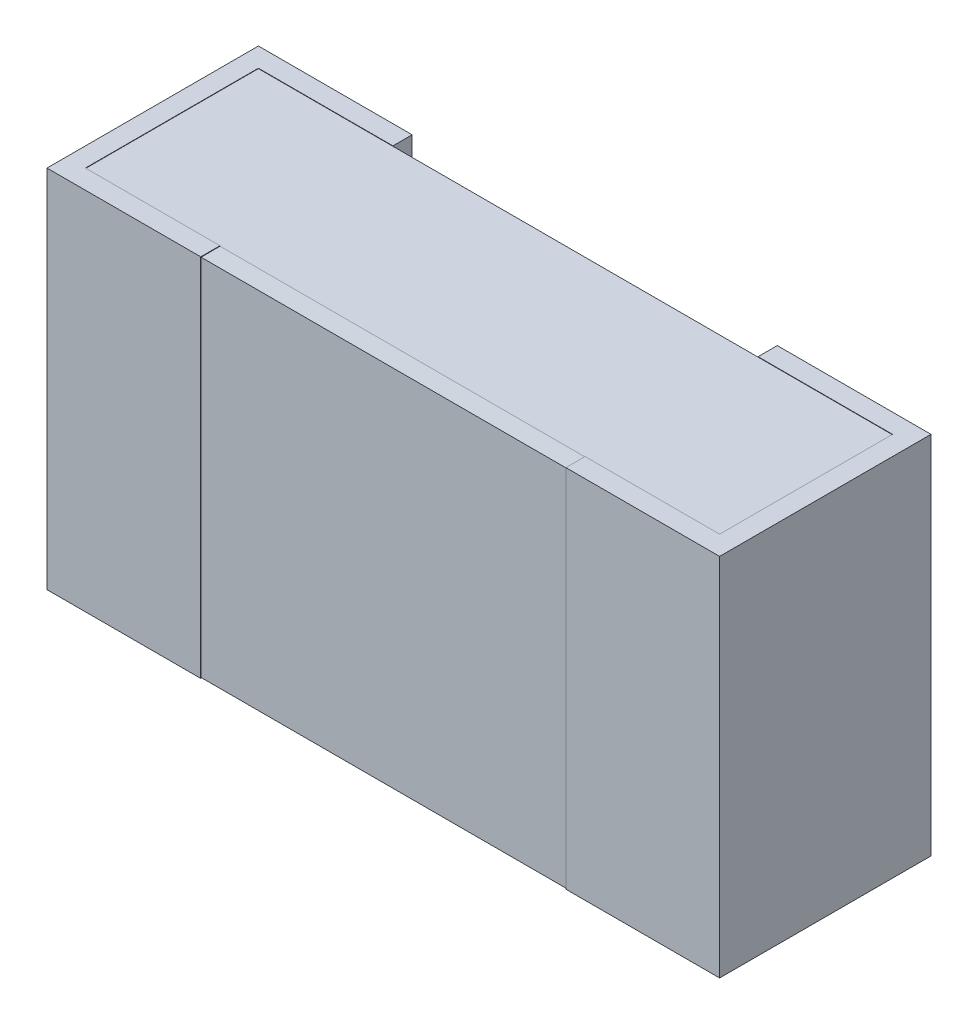
ISO-10303-21;
HEADER;
FILE_DESCRIPTION(('STEP AP214'),'2;1');
FILE_NAME('part.step','',(''),(''),'','','');
FILE_SCHEMA(('AUTOMOTIVE_DESIGN { 1 0 10303 214 1 1 1 1 }'));
ENDSEC;
DATA;
#1=APPLICATION_CONTEXT('core data for automotive mechanical design processes');
#2=APPLICATION_PROTOCOL_DEFINITION('international standard','automotive_design',2000,#1);
#3=PRODUCT_CONTEXT('',#1,'mechanical');
#4=PRODUCT('Part','Part','',(#3));
#5=PRODUCT_RELATED_PRODUCT_CATEGORY('part','',(#4));
#6=PRODUCT_DEFINITION_FORMATION('','',#4);
#7=PRODUCT_DEFINITION_CONTEXT('part definition',#1,'design');
#8=PRODUCT_DEFINITION('design','',#6,#7);
#9=PRODUCT_DEFINITION_SHAPE('','',#8);
#10=(LENGTH_UNIT() NAMED_UNIT(*) SI_UNIT(.MILLI.,.METRE.));
#11=(NAMED_UNIT(*) PLANE_ANGLE_UNIT() SI_UNIT($,.RADIAN.));
#12=(NAMED_UNIT(*) SI_UNIT($,.STERADIAN.) SOLID_ANGLE_UNIT());
#13=UNCERTAINTY_MEASURE_WITH_UNIT(LENGTH_MEASURE(1.E-05),#10,'distance_accuracy_value','');
#14=(GEOMETRIC_REPRESENTATION_CONTEXT(3) GLOBAL_UNCERTAINTY_ASSIGNED_CONTEXT((#13)) GLOBAL_UNIT_ASSIGNED_CONTEXT((#10,
#11,#12)) REPRESENTATION_CONTEXT('',''));
#15=CARTESIAN_POINT('',(0.,0.,0.));
#16=DIRECTION('',(0.,0.,1.));
#17=DIRECTION('',(1.,0.,0.));
#18=AXIS2_PLACEMENT_3D('',#15,#16,#17);
#19=CARTESIAN_POINT('',(0.875000000008,0.475,291599.7194058));
#20=DIRECTION('',(-1.,0.,0.));
#21=DIRECTION('',(0.,0.,1.));
#22=AXIS2_PLACEMENT_3D('',#19,#20,#21);
#23=PLANE('',#22);
#24=DIRECTION('',(0.,1.,0.));
#25=VECTOR('',#24,1.);
#26=CARTESIAN_POINT('',(0.875000000007731,0.475,0.));
#27=LINE('',#26,#25);
#28=CARTESIAN_POINT('',(0.87500000000791,-0.475,0.));
#29=VERTEX_POINT('',#28);
#30=CARTESIAN_POINT('',(0.87500000000791,0.475,0.));
#31=VERTEX_POINT('',#30);
#32=EDGE_CURVE('E186',#29,#31,#27,.T.);
#33=ORIENTED_EDGE('',*,*,#32,.T.);
#34=DIRECTION('',(0.,0.,-1.));
#35=VECTOR('',#34,1.);
#36=CARTESIAN_POINT('',(0.875000000008,0.475,0.04999999998745));
#37=LINE('',#36,#35);
#38=CARTESIAN_POINT('',(0.87500000000791,0.475,0.549999999976));
#39=VERTEX_POINT('',#38);
#40=EDGE_CURVE('E299',#31,#39,#37,.F.);
#41=ORIENTED_EDGE('',*,*,#40,.T.);
#42=DIRECTION('',(0.,1.,0.));
#43=VECTOR('',#42,1.);
#44=CARTESIAN_POINT('',(0.875000000007731,0.475,0.549999999976));
#45=LINE('',#44,#43);
#46=CARTESIAN_POINT('',(0.87500000000791,-0.475,0.549999999976));
#47=VERTEX_POINT('',#46);
#48=EDGE_CURVE('E407',#39,#47,#45,.F.);
#49=ORIENTED_EDGE('',*,*,#48,.T.);
#50=DIRECTION('',(0.,0.,-1.));
#51=VECTOR('',#50,1.);
#52=CARTESIAN_POINT('',(0.875000000008,-0.475,0.04999999998745));
#53=LINE('',#52,#51);
#54=EDGE_CURVE('E178',#29,#47,#53,.F.);
#55=ORIENTED_EDGE('',*,*,#54,.F.);
#56=EDGE_LOOP('',(#33,#41,#49,#55));
#57=FACE_BOUND('',#56,.T.);
#58=ADVANCED_FACE('F17',(#57),#23,.F.);
#59=CARTESIAN_POINT('',(-400000.,0.475,0.549999999976));
#60=DIRECTION('',(0.,0.,-1.));
#61=DIRECTION('',(-1.,0.,0.));
#62=AXIS2_PLACEMENT_3D('',#59,#60,#61);
#63=PLANE('',#62);
#64=ORIENTED_EDGE('',*,*,#48,.F.);
#65=DIRECTION('',(1.,0.,0.));
#66=VECTOR('',#65,1.);
#67=CARTESIAN_POINT('',(0.82500000002,0.475,0.549999999976));
#68=LINE('',#67,#66);
#69=CARTESIAN_POINT('',(0.474999999994,0.475,0.549999999975875));
#70=VERTEX_POINT('',#69);
#71=EDGE_CURVE('E378',#39,#70,#68,.F.);
#72=ORIENTED_EDGE('',*,*,#71,.T.);
#73=DIRECTION('',(0.,1.,0.));
#74=VECTOR('',#73,1.);
#75=CARTESIAN_POINT('',(0.474999999994,0.475,0.549999999975626));
#76=LINE('',#75,#74);
#77=CARTESIAN_POINT('',(0.474999999994,-0.475,0.549999999975875));
#78=VERTEX_POINT('',#77);
#79=EDGE_CURVE('E384',#70,#78,#76,.F.);
#80=ORIENTED_EDGE('',*,*,#79,.T.);
#81=DIRECTION('',(1.,0.,0.));
#82=VECTOR('',#81,1.);
#83=CARTESIAN_POINT('',(0.82500000002,-0.475,0.549999999976));
#84=LINE('',#83,#82);
#85=EDGE_CURVE('E402',#47,#78,#84,.F.);
#86=ORIENTED_EDGE('',*,*,#85,.F.);
#87=EDGE_LOOP('',(#64,#72,#80,#86));
#88=FACE_BOUND('',#87,.T.);
#89=ADVANCED_FACE('F634',(#88),#63,.F.);
#90=CARTESIAN_POINT('',(-400000.,0.473,0.548999999978));
#91=DIRECTION('',(0.,0.,-1.));
#92=DIRECTION('',(-1.,0.,0.));
#93=AXIS2_PLACEMENT_3D('',#90,#91,#92);
#94=PLANE('',#93);
#95=DIRECTION('',(1.,0.,0.));
#96=VECTOR('',#95,1.);
#97=CARTESIAN_POINT('',(-400000.,-0.4735100000001,0.548999999978001));
#98=LINE('',#97,#96);
#99=CARTESIAN_POINT('',(0.474999999994301,-0.473510000000067,0.548999999978051));
#100=VERTEX_POINT('',#99);
#101=CARTESIAN_POINT('',(-0.474999999994301,-0.473510000000067,0.548999999978051));
#102=VERTEX_POINT('',#101);
#103=EDGE_CURVE('E315',#100,#102,#98,.F.);
#104=ORIENTED_EDGE('',*,*,#103,.F.);
#105=DIRECTION('',(0.,1.,0.));
#106=VECTOR('',#105,1.);
#107=CARTESIAN_POINT('',(0.474999999994,0.475,0.54899999997815));
#108=LINE('',#107,#106);
#109=CARTESIAN_POINT('',(0.474999999994,0.4735100000001,0.548999999978051));
#110=VERTEX_POINT('',#109);
#111=EDGE_CURVE('E381',#100,#110,#108,.T.);
#112=ORIENTED_EDGE('',*,*,#111,.T.);
#113=DIRECTION('',(1.,0.,0.));
#114=VECTOR('',#113,1.);
#115=CARTESIAN_POINT('',(-0.474999999994,0.4735100000001,0.548999999978001));
#116=LINE('',#115,#114);
#117=CARTESIAN_POINT('',(-0.474999999994,0.4735100000001,0.548999999978051));
#118=VERTEX_POINT('',#117);
#119=EDGE_CURVE('E271',#110,#118,#116,.F.);
#120=ORIENTED_EDGE('',*,*,#119,.T.);
#121=DIRECTION('',(0.,1.,0.));
#122=VECTOR('',#121,1.);
#123=CARTESIAN_POINT('',(-0.474999999994,0.475,0.54899999997815));
#124=LINE('',#123,#122);
#125=EDGE_CURVE('E352',#118,#102,#124,.F.);
#126=ORIENTED_EDGE('',*,*,#125,.T.);
#127=EDGE_LOOP('',(#104,#112,#120,#126));
#128=FACE_BOUND('',#127,.T.);
#129=ADVANCED_FACE('F535',(#128),#94,.F.);
#130=CARTESIAN_POINT('',(0.474999999994,0.475,291599.7194058));
#131=DIRECTION('',(1.,0.,0.));
#132=DIRECTION('',(0.,0.,-1.));
#133=AXIS2_PLACEMENT_3D('',#130,#131,#132);
#134=PLANE('',#133);
#135=ORIENTED_EDGE('',*,*,#111,.F.);
#136=DIRECTION('',(0.,-0.00999950003749388,-0.999950003749688));
#137=VECTOR('',#136,1.);
#138=CARTESIAN_POINT('',(0.474999999994452,-0.474,0.499999999988));
#139=LINE('',#138,#137);
#140=CARTESIAN_POINT('',(0.474999999994226,-0.474,0.499999999988044));
#141=VERTEX_POINT('',#140);
#142=EDGE_CURVE('E312',#141,#100,#139,.F.);
#143=ORIENTED_EDGE('',*,*,#142,.F.);
#144=DIRECTION('',(0.,1.,0.));
#145=VECTOR('',#144,1.);
#146=CARTESIAN_POINT('',(0.474999999994,0.475,0.499999999988177));
#147=LINE('',#146,#145);
#148=CARTESIAN_POINT('',(0.474999999994,-0.475,0.499999999988088));
#149=VERTEX_POINT('',#148);
#150=EDGE_CURVE('E322',#141,#149,#147,.F.);
#151=ORIENTED_EDGE('',*,*,#150,.T.);
#152=DIRECTION('',(0.,0.,-1.));
#153=VECTOR('',#152,1.);
#154=CARTESIAN_POINT('',(0.474999999994,-0.475,0.04999999998745));
#155=LINE('',#154,#153);
#156=EDGE_CURVE('E398',#78,#149,#155,.T.);
#157=ORIENTED_EDGE('',*,*,#156,.F.);
#158=ORIENTED_EDGE('',*,*,#79,.F.);
#159=DIRECTION('',(0.,0.,-1.));
#160=VECTOR('',#159,1.);
#161=CARTESIAN_POINT('',(0.474999999994,0.475,0.04999999998745));
#162=LINE('',#161,#160);
#163=CARTESIAN_POINT('',(0.474999999994113,0.475,0.499999999988088));
#164=VERTEX_POINT('',#163);
#165=EDGE_CURVE('E376',#70,#164,#162,.T.);
#166=ORIENTED_EDGE('',*,*,#165,.T.);
#167=DIRECTION('',(0.,1.,0.));
#168=VECTOR('',#167,1.);
#169=CARTESIAN_POINT('',(0.474999999994,0.475,0.499999999988177));
#170=LINE('',#169,#168);
#171=CARTESIAN_POINT('',(0.474999999994,0.473999999999999,0.499999999988088));
#172=VERTEX_POINT('',#171);
#173=EDGE_CURVE('E259',#164,#172,#170,.F.);
#174=ORIENTED_EDGE('',*,*,#173,.T.);
#175=DIRECTION('',(0.,0.00999950003749388,-0.999950003749688));
#176=VECTOR('',#175,1.);
#177=CARTESIAN_POINT('',(0.474999999994,0.473,0.599999999988));
#178=LINE('',#177,#176);
#179=EDGE_CURVE('E260',#172,#110,#178,.F.);
#180=ORIENTED_EDGE('',*,*,#179,.T.);
#181=EDGE_LOOP('',(#135,#143,#151,#157,#158,#166,#174,#180));
#182=FACE_BOUND('',#181,.T.);
#183=ADVANCED_FACE('F531',(#182),#134,.F.);
#184=CARTESIAN_POINT('',(-0.474999999994,0.475,291599.7194058));
#185=DIRECTION('',(-1.,0.,0.));
#186=DIRECTION('',(0.,0.,1.));
#187=AXIS2_PLACEMENT_3D('',#184,#185,#186);
#188=PLANE('',#187);
#189=DIRECTION('',(0.,0.00999950003749388,-0.999950003749688));
#190=VECTOR('',#189,1.);
#191=CARTESIAN_POINT('',(-0.474999999994,0.473,0.599999999988));
#192=LINE('',#191,#190);
#193=CARTESIAN_POINT('',(-0.474999999994,0.473999999999999,0.499999999988088));
#194=VERTEX_POINT('',#193);
#195=EDGE_CURVE('E266',#118,#194,#192,.T.);
#196=ORIENTED_EDGE('',*,*,#195,.T.);
#197=DIRECTION('',(0.,1.,0.));
#198=VECTOR('',#197,1.);
#199=CARTESIAN_POINT('',(-0.474999999994,0.475,0.499999999988177));
#200=LINE('',#199,#198);
#201=CARTESIAN_POINT('',(-0.474999999994,0.475,0.499999999988088));
#202=VERTEX_POINT('',#201);
#203=EDGE_CURVE('E281',#194,#202,#200,.T.);
#204=ORIENTED_EDGE('',*,*,#203,.T.);
#205=DIRECTION('',(0.,0.,-1.));
#206=VECTOR('',#205,1.);
#207=CARTESIAN_POINT('',(-0.474999999994,0.475,0.499999999988));
#208=LINE('',#207,#206);
#209=CARTESIAN_POINT('',(-0.474999999994151,0.475,0.549999999976));
#210=VERTEX_POINT('',#209);
#211=EDGE_CURVE('E366',#202,#210,#208,.F.);
#212=ORIENTED_EDGE('',*,*,#211,.T.);
#213=DIRECTION('',(0.,1.,0.));
#214=VECTOR('',#213,1.);
#215=CARTESIAN_POINT('',(-0.474999999994452,0.475,0.549999999976));
#216=LINE('',#215,#214);
#217=CARTESIAN_POINT('',(-0.474999999994151,-0.475,0.549999999976));
#218=VERTEX_POINT('',#217);
#219=EDGE_CURVE('E345',#210,#218,#216,.F.);
#220=ORIENTED_EDGE('',*,*,#219,.T.);
#221=DIRECTION('',(0.,0.,-1.));
#222=VECTOR('',#221,1.);
#223=CARTESIAN_POINT('',(-0.474999999994,-0.475,0.499999999988));
#224=LINE('',#223,#222);
#225=CARTESIAN_POINT('',(-0.474999999994,-0.475,0.499999999988088));
#226=VERTEX_POINT('',#225);
#227=EDGE_CURVE('E152',#226,#218,#224,.F.);
#228=ORIENTED_EDGE('',*,*,#227,.F.);
#229=DIRECTION('',(0.,1.,0.));
#230=VECTOR('',#229,1.);
#231=CARTESIAN_POINT('',(-0.474999999994,0.475,0.499999999988177));
#232=LINE('',#231,#230);
#233=CARTESIAN_POINT('',(-0.474999999994226,-0.474,0.499999999988044));
#234=VERTEX_POINT('',#233);
#235=EDGE_CURVE('E20',#226,#234,#232,.T.);
#236=ORIENTED_EDGE('',*,*,#235,.T.);
#237=DIRECTION('',(0.,-0.00999950003749388,-0.999950003749688));
#238=VECTOR('',#237,1.);
#239=CARTESIAN_POINT('',(-0.474999999994452,-0.474,0.499999999988));
#240=LINE('',#239,#238);
#241=EDGE_CURVE('E319',#102,#234,#240,.T.);
#242=ORIENTED_EDGE('',*,*,#241,.F.);
#243=ORIENTED_EDGE('',*,*,#125,.F.);
#244=EDGE_LOOP('',(#196,#204,#212,#220,#228,#236,#242,#243));
#245=FACE_BOUND('',#244,.T.);
#246=ADVANCED_FACE('F465',(#245),#188,.F.);
#247=CARTESIAN_POINT('',(-400000.,0.475,0.549999999976));
#248=DIRECTION('',(0.,0.,-1.));
#249=DIRECTION('',(-1.,0.,0.));
#250=AXIS2_PLACEMENT_3D('',#247,#248,#249);
#251=PLANE('',#250);
#252=ORIENTED_EDGE('',*,*,#219,.F.);
#253=DIRECTION('',(1.,0.,0.));
#254=VECTOR('',#253,1.);
#255=CARTESIAN_POINT('',(-0.82500000002,0.475,0.549999999976));
#256=LINE('',#255,#254);
#257=CARTESIAN_POINT('',(-0.875000000008,0.475,0.549999999975875));
#258=VERTEX_POINT('',#257);
#259=EDGE_CURVE('E359',#210,#258,#256,.F.);
#260=ORIENTED_EDGE('',*,*,#259,.T.);
#261=DIRECTION('',(0.,1.,0.));
#262=VECTOR('',#261,1.);
#263=CARTESIAN_POINT('',(-0.875000000008,0.475,0.549999999975626));
#264=LINE('',#263,#262);
#265=CARTESIAN_POINT('',(-0.875000000008,-0.475,0.549999999975875));
#266=VERTEX_POINT('',#265);
#267=EDGE_CURVE('E342',#258,#266,#264,.F.);
#268=ORIENTED_EDGE('',*,*,#267,.T.);
#269=DIRECTION('',(1.,0.,0.));
#270=VECTOR('',#269,1.);
#271=CARTESIAN_POINT('',(-0.82500000002,-0.475,0.549999999976));
#272=LINE('',#271,#270);
#273=EDGE_CURVE('E339',#218,#266,#272,.F.);
#274=ORIENTED_EDGE('',*,*,#273,.F.);
#275=EDGE_LOOP('',(#252,#260,#268,#274));
#276=FACE_BOUND('',#275,.T.);
#277=ADVANCED_FACE('F616',(#276),#251,.F.);
#278=CARTESIAN_POINT('',(-0.875000000008,0.475,291599.7194058));
#279=DIRECTION('',(1.,0.,0.));
#280=DIRECTION('',(0.,0.,-1.));
#281=AXIS2_PLACEMENT_3D('',#278,#279,#280);
#282=PLANE('',#281);
#283=ORIENTED_EDGE('',*,*,#267,.F.);
#284=DIRECTION('',(0.,0.,-1.));
#285=VECTOR('',#284,1.);
#286=CARTESIAN_POINT('',(-0.875000000008,0.475,0.499999999988));
#287=LINE('',#286,#285);
#288=CARTESIAN_POINT('',(-0.875000000007821,0.475,0.));
#289=VERTEX_POINT('',#288);
#290=EDGE_CURVE('E244',#258,#289,#287,.T.);
#291=ORIENTED_EDGE('',*,*,#290,.T.);
#292=DIRECTION('',(0.,1.,0.));
#293=VECTOR('',#292,1.);
#294=CARTESIAN_POINT('',(-0.875000000007731,0.475,0.));
#295=LINE('',#294,#293);
#296=CARTESIAN_POINT('',(-0.87500000000791,-0.475,0.));
#297=VERTEX_POINT('',#296);
#298=EDGE_CURVE('E236',#289,#297,#295,.F.);
#299=ORIENTED_EDGE('',*,*,#298,.T.);
#300=DIRECTION('',(0.,0.,-1.));
#301=VECTOR('',#300,1.);
#302=CARTESIAN_POINT('',(-0.875000000008,-0.475,0.499999999988));
#303=LINE('',#302,#301);
#304=EDGE_CURVE('E208',#266,#297,#303,.T.);
#305=ORIENTED_EDGE('',*,*,#304,.F.);
#306=EDGE_LOOP('',(#283,#291,#299,#305));
#307=FACE_BOUND('',#306,.T.);
#308=ADVANCED_FACE('F618',(#307),#282,.F.);
#309=CARTESIAN_POINT('',(-0.82500000002,0.475,291599.7194058));
#310=DIRECTION('',(-1.,0.,0.));
#311=DIRECTION('',(0.,0.,1.));
#312=AXIS2_PLACEMENT_3D('',#309,#310,#311);
#313=PLANE('',#312);
#314=DIRECTION('',(0.,0.,1.));
#315=VECTOR('',#314,1.);
#316=CARTESIAN_POINT('',(-0.82500000002,-0.474,0.04999999998745));
#317=LINE('',#316,#315);
#318=CARTESIAN_POINT('',(-0.82500000002,-0.474,0.0499999999874495));
#319=VERTEX_POINT('',#318);
#320=CARTESIAN_POINT('',(-0.82500000002,-0.474,0.499999999988088));
#321=VERTEX_POINT('',#320);
#322=EDGE_CURVE('E326',#319,#321,#317,.T.);
#323=ORIENTED_EDGE('',*,*,#322,.T.);
#324=DIRECTION('',(0.,1.,0.));
#325=VECTOR('',#324,1.);
#326=CARTESIAN_POINT('',(-0.82500000002,0.475,0.499999999988177));
#327=LINE('',#326,#325);
#328=CARTESIAN_POINT('',(-0.82500000002,-0.475,0.499999999988088));
#329=VERTEX_POINT('',#328);
#330=EDGE_CURVE('E316',#321,#329,#327,.F.);
#331=ORIENTED_EDGE('',*,*,#330,.T.);
#332=DIRECTION('',(0.,0.,-1.));
#333=VECTOR('',#332,1.);
#334=CARTESIAN_POINT('',(-0.82500000002,-0.475,0.499999999988));
#335=LINE('',#334,#333);
#336=CARTESIAN_POINT('',(-0.82500000002,-0.475,0.0499999999874495));
#337=VERTEX_POINT('',#336);
#338=EDGE_CURVE('E330',#337,#329,#335,.F.);
#339=ORIENTED_EDGE('',*,*,#338,.F.);
#340=DIRECTION('',(0.,1.,0.));
#341=VECTOR('',#340,1.);
#342=CARTESIAN_POINT('',(-0.82500000002,0.475,0.049999999987449));
#343=LINE('',#342,#341);
#344=EDGE_CURVE('E444',#337,#319,#343,.T.);
#345=ORIENTED_EDGE('',*,*,#344,.T.);
#346=EDGE_LOOP('',(#323,#331,#339,#345));
#347=FACE_BOUND('',#346,.T.);
#348=ADVANCED_FACE('F474',(#347),#313,.F.);
#349=CARTESIAN_POINT('',(-400000.,0.475,0.499999999988));
#350=DIRECTION('',(0.,0.,1.));
#351=DIRECTION('',(1.,0.,0.));
#352=AXIS2_PLACEMENT_3D('',#349,#350,#351);
#353=PLANE('',#352);
#354=DIRECTION('',(1.,0.,0.));
#355=VECTOR('',#354,1.);
#356=CARTESIAN_POINT('',(-0.82500000002,-0.474,0.499999999988));
#357=LINE('',#356,#355);
#358=EDGE_CURVE('E311',#321,#234,#357,.T.);
#359=ORIENTED_EDGE('',*,*,#358,.T.);
#360=ORIENTED_EDGE('',*,*,#235,.F.);
#361=DIRECTION('',(1.,0.,0.));
#362=VECTOR('',#361,1.);
#363=CARTESIAN_POINT('',(-0.82500000002,-0.475,0.499999999988));
#364=LINE('',#363,#362);
#365=EDGE_CURVE('E333',#329,#226,#364,.T.);
#366=ORIENTED_EDGE('',*,*,#365,.F.);
#367=ORIENTED_EDGE('',*,*,#330,.F.);
#368=EDGE_LOOP('',(#359,#360,#366,#367));
#369=FACE_BOUND('',#368,.T.);
#370=ADVANCED_FACE('F473',(#369),#353,.F.);
#371=CARTESIAN_POINT('',(-400000.,-0.474,0.499999999988));
#372=DIRECTION('',(0.,-0.999950003749688,0.00999950003749388));
#373=DIRECTION('',(0.,-0.00999950003749388,-0.999950003749688));
#374=AXIS2_PLACEMENT_3D('',#371,#372,#373);
#375=PLANE('',#374);
#376=ORIENTED_EDGE('',*,*,#241,.T.);
#377=DIRECTION('',(1.,0.,0.));
#378=VECTOR('',#377,1.);
#379=CARTESIAN_POINT('',(-0.82500000002,-0.474,0.499999999988));
#380=LINE('',#379,#378);
#381=EDGE_CURVE('E308',#234,#141,#380,.T.);
#382=ORIENTED_EDGE('',*,*,#381,.T.);
#383=ORIENTED_EDGE('',*,*,#142,.T.);
#384=ORIENTED_EDGE('',*,*,#103,.T.);
#385=EDGE_LOOP('',(#376,#382,#383,#384));
#386=FACE_BOUND('',#385,.T.);
#387=ADVANCED_FACE('F533',(#386),#375,.T.);
#388=CARTESIAN_POINT('',(-400000.,0.475,0.499999999988));
#389=DIRECTION('',(0.,0.,1.));
#390=DIRECTION('',(1.,0.,0.));
#391=AXIS2_PLACEMENT_3D('',#388,#389,#390);
#392=PLANE('',#391);
#393=DIRECTION('',(1.,0.,0.));
#394=VECTOR('',#393,1.);
#395=CARTESIAN_POINT('',(-0.82500000002,-0.474,0.499999999988));
#396=LINE('',#395,#394);
#397=CARTESIAN_POINT('',(0.825000000020141,-0.474,0.499999999988));
#398=VERTEX_POINT('',#397);
#399=EDGE_CURVE('E305',#141,#398,#396,.T.);
#400=ORIENTED_EDGE('',*,*,#399,.T.);
#401=DIRECTION('',(0.,1.,0.));
#402=VECTOR('',#401,1.);
#403=CARTESIAN_POINT('',(0.825000000020282,0.475,0.499999999988));
#404=LINE('',#403,#402);
#405=CARTESIAN_POINT('',(0.825000000020141,-0.475,0.499999999988));
#406=VERTEX_POINT('',#405);
#407=EDGE_CURVE('E420',#398,#406,#404,.F.);
#408=ORIENTED_EDGE('',*,*,#407,.T.);
#409=DIRECTION('',(1.,0.,0.));
#410=VECTOR('',#409,1.);
#411=CARTESIAN_POINT('',(0.82500000002,-0.475,0.499999999988));
#412=LINE('',#411,#410);
#413=EDGE_CURVE('E396',#149,#406,#412,.T.);
#414=ORIENTED_EDGE('',*,*,#413,.F.);
#415=ORIENTED_EDGE('',*,*,#150,.F.);
#416=EDGE_LOOP('',(#400,#408,#414,#415));
#417=FACE_BOUND('',#416,.T.);
#418=ADVANCED_FACE('F527',(#417),#392,.F.);
#419=CARTESIAN_POINT('',(0.82500000002,0.475,291599.7194058));
#420=DIRECTION('',(1.,0.,0.));
#421=DIRECTION('',(0.,0.,-1.));
#422=AXIS2_PLACEMENT_3D('',#419,#420,#421);
#423=PLANE('',#422);
#424=DIRECTION('',(0.,0.,1.));
#425=VECTOR('',#424,1.);
#426=CARTESIAN_POINT('',(0.82500000002,-0.474,0.04999999998745));
#427=LINE('',#426,#425);
#428=CARTESIAN_POINT('',(0.82500000002,-0.474,0.0499999999874495));
#429=VERTEX_POINT('',#428);
#430=EDGE_CURVE('E302',#398,#429,#427,.F.);
#431=ORIENTED_EDGE('',*,*,#430,.T.);
#432=DIRECTION('',(0.,1.,0.));
#433=VECTOR('',#432,1.);
#434=CARTESIAN_POINT('',(0.82500000002,0.475,0.049999999987449));
#435=LINE('',#434,#433);
#436=CARTESIAN_POINT('',(0.82500000002,-0.475,0.0499999999874495));
#437=VERTEX_POINT('',#436);
#438=EDGE_CURVE('E286',#429,#437,#435,.F.);
#439=ORIENTED_EDGE('',*,*,#438,.T.);
#440=DIRECTION('',(0.,0.,-1.));
#441=VECTOR('',#440,1.);
#442=CARTESIAN_POINT('',(0.82500000002,-0.475,0.04999999998745));
#443=LINE('',#442,#441);
#444=EDGE_CURVE('E282',#406,#437,#443,.T.);
#445=ORIENTED_EDGE('',*,*,#444,.F.);
#446=ORIENTED_EDGE('',*,*,#407,.F.);
#447=EDGE_LOOP('',(#431,#439,#445,#446));
#448=FACE_BOUND('',#447,.T.);
#449=ADVANCED_FACE('F525',(#448),#423,.F.);
#450=CARTESIAN_POINT('',(-400000.,0.475,0.));
#451=DIRECTION('',(0.,0.,1.));
#452=DIRECTION('',(1.,0.,0.));
#453=AXIS2_PLACEMENT_3D('',#450,#451,#452);
#454=PLANE('',#453);
#455=DIRECTION('',(0.,1.,0.));
#456=VECTOR('',#455,1.);
#457=CARTESIAN_POINT('',(0.474999999994,0.475,0.));
#458=LINE('',#457,#456);
#459=CARTESIAN_POINT('',(0.474999999994,-0.475,0.));
#460=VERTEX_POINT('',#459);
#461=CARTESIAN_POINT('',(0.474999999994,0.475,0.));
#462=VERTEX_POINT('',#461);
#463=EDGE_CURVE('E290',#460,#462,#458,.T.);
#464=ORIENTED_EDGE('',*,*,#463,.T.);
#465=DIRECTION('',(1.,0.,0.));
#466=VECTOR('',#465,1.);
#467=CARTESIAN_POINT('',(0.82500000002,0.475,0.));
#468=LINE('',#467,#466);
#469=EDGE_CURVE('E297',#462,#31,#468,.T.);
#470=ORIENTED_EDGE('',*,*,#469,.T.);
#471=ORIENTED_EDGE('',*,*,#32,.F.);
#472=DIRECTION('',(1.,0.,0.));
#473=VECTOR('',#472,1.);
#474=CARTESIAN_POINT('',(0.82500000002,-0.475,0.));
#475=LINE('',#474,#473);
#476=EDGE_CURVE('E285',#460,#29,#475,.T.);
#477=ORIENTED_EDGE('',*,*,#476,.F.);
#478=EDGE_LOOP('',(#464,#470,#471,#477));
#479=FACE_BOUND('',#478,.T.);
#480=ADVANCED_FACE('F520',(#479),#454,.F.);
#481=CARTESIAN_POINT('',(0.82500000002,0.475,0.04999999998745));
#482=DIRECTION('',(0.,-1.,0.));
#483=DIRECTION('',(0.,0.,-1.));
#484=AXIS2_PLACEMENT_3D('',#481,#482,#483);
#485=PLANE('',#484);
#486=DIRECTION('',(0.,0.,-1.));
#487=VECTOR('',#486,1.);
#488=CARTESIAN_POINT('',(0.82500000002,0.475,291599.7194058));
#489=LINE('',#488,#487);
#490=CARTESIAN_POINT('',(0.825000000020211,0.475,0.0499999999894221));
#491=VERTEX_POINT('',#490);
#492=CARTESIAN_POINT('',(0.825000000020211,0.475,0.499999999988044));
#493=VERTEX_POINT('',#492);
#494=EDGE_CURVE('E245',#491,#493,#489,.F.);
#495=ORIENTED_EDGE('',*,*,#494,.T.);
#496=DIRECTION('',(1.,0.,0.));
#497=VECTOR('',#496,1.);
#498=CARTESIAN_POINT('',(-400000.,0.475,0.499999999988));
#499=LINE('',#498,#497);
#500=EDGE_CURVE('E256',#493,#164,#499,.F.);
#501=ORIENTED_EDGE('',*,*,#500,.T.);
#502=ORIENTED_EDGE('',*,*,#165,.F.);
#503=ORIENTED_EDGE('',*,*,#71,.F.);
#504=ORIENTED_EDGE('',*,*,#40,.F.);
#505=ORIENTED_EDGE('',*,*,#469,.F.);
#506=DIRECTION('',(0.,0.,-1.));
#507=VECTOR('',#506,1.);
#508=CARTESIAN_POINT('',(0.474999999994,0.475,291599.7194058));
#509=LINE('',#508,#507);
#510=CARTESIAN_POINT('',(0.474999999994339,0.475,0.0499999999894221));
#511=VERTEX_POINT('',#510);
#512=EDGE_CURVE('E293',#462,#511,#509,.F.);
#513=ORIENTED_EDGE('',*,*,#512,.T.);
#514=DIRECTION('',(-1.,0.,0.));
#515=VECTOR('',#514,1.);
#516=CARTESIAN_POINT('',(-400000.,0.475,0.05000000004429));
#517=LINE('',#516,#515);
#518=EDGE_CURVE('E279',#511,#491,#517,.F.);
#519=ORIENTED_EDGE('',*,*,#518,.T.);
#520=EDGE_LOOP('',(#495,#501,#502,#503,#504,#505,#513,#519));
#521=FACE_BOUND('',#520,.T.);
#522=ADVANCED_FACE('F515',(#521),#485,.F.);
#523=CARTESIAN_POINT('',(-400000.,0.475,0.05000000004429));
#524=DIRECTION('',(0.,0.,-1.));
#525=DIRECTION('',(-1.,0.,0.));
#526=AXIS2_PLACEMENT_3D('',#523,#524,#525);
#527=PLANE('',#526);
#528=DIRECTION('',(1.,0.,0.));
#529=VECTOR('',#528,1.);
#530=CARTESIAN_POINT('',(-0.82500000002,-0.474,0.04999999998745));
#531=LINE('',#530,#529);
#532=CARTESIAN_POINT('',(0.474999999994226,-0.474,0.0499999999887649));
#533=VERTEX_POINT('',#532);
#534=EDGE_CURVE('E294',#429,#533,#531,.F.);
#535=ORIENTED_EDGE('',*,*,#534,.T.);
#536=DIRECTION('',(0.,1.,0.));
#537=VECTOR('',#536,1.);
#538=CARTESIAN_POINT('',(0.474999999994452,0.475,0.0499999999900798));
#539=LINE('',#538,#537);
#540=CARTESIAN_POINT('',(0.474999999994226,-0.475,0.0499999999881072));
#541=VERTEX_POINT('',#540);
#542=EDGE_CURVE('E436',#533,#541,#539,.F.);
#543=ORIENTED_EDGE('',*,*,#542,.T.);
#544=DIRECTION('',(1.,0.,0.));
#545=VECTOR('',#544,1.);
#546=CARTESIAN_POINT('',(0.82500000002,-0.475,0.04999999998745));
#547=LINE('',#546,#545);
#548=EDGE_CURVE('E283',#437,#541,#547,.F.);
#549=ORIENTED_EDGE('',*,*,#548,.F.);
#550=ORIENTED_EDGE('',*,*,#438,.F.);
#551=EDGE_LOOP('',(#535,#543,#549,#550));
#552=FACE_BOUND('',#551,.T.);
#553=ADVANCED_FACE('F490',(#552),#527,.F.);
#554=CARTESIAN_POINT('',(0.82500000002,-0.475,0.04999999998745));
#555=DIRECTION('',(0.,-1.,0.));
#556=DIRECTION('',(0.,0.,-1.));
#557=AXIS2_PLACEMENT_3D('',#554,#555,#556);
#558=PLANE('',#557);
#559=ORIENTED_EDGE('',*,*,#413,.T.);
#560=ORIENTED_EDGE('',*,*,#444,.T.);
#561=ORIENTED_EDGE('',*,*,#548,.T.);
#562=DIRECTION('',(0.,0.,-1.));
#563=VECTOR('',#562,1.);
#564=CARTESIAN_POINT('',(0.474999999994,-0.475,291599.7194058));
#565=LINE('',#564,#563);
#566=EDGE_CURVE('E439',#541,#460,#565,.T.);
#567=ORIENTED_EDGE('',*,*,#566,.T.);
#568=ORIENTED_EDGE('',*,*,#476,.T.);
#569=ORIENTED_EDGE('',*,*,#54,.T.);
#570=ORIENTED_EDGE('',*,*,#85,.T.);
#571=ORIENTED_EDGE('',*,*,#156,.T.);
#572=EDGE_LOOP('',(#559,#560,#561,#567,#568,#569,#570,#571));
#573=FACE_BOUND('',#572,.T.);
#574=ADVANCED_FACE('F521',(#573),#558,.T.);
#575=CARTESIAN_POINT('',(-400000.,0.475,0.05000000004429));
#576=DIRECTION('',(0.,0.,-1.));
#577=DIRECTION('',(-1.,0.,0.));
#578=AXIS2_PLACEMENT_3D('',#575,#576,#577);
#579=PLANE('',#578);
#580=DIRECTION('',(0.,1.,0.));
#581=VECTOR('',#580,1.);
#582=CARTESIAN_POINT('',(0.825000000020282,0.475,0.0499999999900798));
#583=LINE('',#582,#581);
#584=CARTESIAN_POINT('',(0.82500000002007,0.474,0.0499999999887649));
#585=VERTEX_POINT('',#584);
#586=EDGE_CURVE('E249',#585,#491,#583,.T.);
#587=ORIENTED_EDGE('',*,*,#586,.T.);
#588=ORIENTED_EDGE('',*,*,#518,.F.);
#589=DIRECTION('',(0.,1.,0.));
#590=VECTOR('',#589,1.);
#591=CARTESIAN_POINT('',(0.474999999994452,0.475,0.0499999999900798));
#592=LINE('',#591,#590);
#593=CARTESIAN_POINT('',(0.474999999994452,0.474,0.0499999999887649));
#594=VERTEX_POINT('',#593);
#595=EDGE_CURVE('E440',#511,#594,#592,.F.);
#596=ORIENTED_EDGE('',*,*,#595,.T.);
#597=DIRECTION('',(1.,0.,0.));
#598=VECTOR('',#597,1.);
#599=CARTESIAN_POINT('',(-0.82500000002,0.474,0.04999999998745));
#600=LINE('',#599,#598);
#601=EDGE_CURVE('E507',#585,#594,#600,.F.);
#602=ORIENTED_EDGE('',*,*,#601,.F.);
#603=EDGE_LOOP('',(#587,#588,#596,#602));
#604=FACE_BOUND('',#603,.T.);
#605=ADVANCED_FACE('F554',(#604),#579,.F.);
#606=CARTESIAN_POINT('',(-0.82500000002,0.475,291599.7194058));
#607=DIRECTION('',(-1.,0.,0.));
#608=DIRECTION('',(0.,0.,1.));
#609=AXIS2_PLACEMENT_3D('',#606,#607,#608);
#610=PLANE('',#609);
#611=DIRECTION('',(0.,1.,0.));
#612=VECTOR('',#611,1.);
#613=CARTESIAN_POINT('',(-0.82500000002,0.475,0.049999999987449));
#614=LINE('',#613,#612);
#615=CARTESIAN_POINT('',(-0.82500000002,0.474,0.0499999999874495));
#616=VERTEX_POINT('',#615);
#617=CARTESIAN_POINT('',(-0.82500000002,0.475,0.0499999999874495));
#618=VERTEX_POINT('',#617);
#619=EDGE_CURVE('E369',#616,#618,#614,.T.);
#620=ORIENTED_EDGE('',*,*,#619,.T.);
#621=DIRECTION('',(0.,0.,-1.));
#622=VECTOR('',#621,1.);
#623=CARTESIAN_POINT('',(-0.82500000002,0.475,0.499999999988));
#624=LINE('',#623,#622);
#625=CARTESIAN_POINT('',(-0.82500000002,0.475,0.499999999988088));
#626=VERTEX_POINT('',#625);
#627=EDGE_CURVE('E243',#618,#626,#624,.F.);
#628=ORIENTED_EDGE('',*,*,#627,.T.);
#629=DIRECTION('',(0.,1.,0.));
#630=VECTOR('',#629,1.);
#631=CARTESIAN_POINT('',(-0.82500000002,0.475,0.499999999988177));
#632=LINE('',#631,#630);
#633=CARTESIAN_POINT('',(-0.82500000002,0.474,0.499999999988088));
#634=VERTEX_POINT('',#633);
#635=EDGE_CURVE('E389',#626,#634,#632,.F.);
#636=ORIENTED_EDGE('',*,*,#635,.T.);
#637=DIRECTION('',(0.,0.,1.));
#638=VECTOR('',#637,1.);
#639=CARTESIAN_POINT('',(-0.82500000002,0.474,0.04999999998745));
#640=LINE('',#639,#638);
#641=EDGE_CURVE('E276',#616,#634,#640,.T.);
#642=ORIENTED_EDGE('',*,*,#641,.F.);
#643=EDGE_LOOP('',(#620,#628,#636,#642));
#644=FACE_BOUND('',#643,.T.);
#645=ADVANCED_FACE('F556',(#644),#610,.F.);
#646=CARTESIAN_POINT('',(-400000.,0.475,0.499999999988));
#647=DIRECTION('',(0.,0.,1.));
#648=DIRECTION('',(1.,0.,0.));
#649=AXIS2_PLACEMENT_3D('',#646,#647,#648);
#650=PLANE('',#649);
#651=ORIENTED_EDGE('',*,*,#635,.F.);
#652=DIRECTION('',(1.,0.,0.));
#653=VECTOR('',#652,1.);
#654=CARTESIAN_POINT('',(-0.82500000002,0.475,0.499999999988));
#655=LINE('',#654,#653);
#656=EDGE_CURVE('E237',#626,#202,#655,.T.);
#657=ORIENTED_EDGE('',*,*,#656,.T.);
#658=ORIENTED_EDGE('',*,*,#203,.F.);
#659=DIRECTION('',(1.,0.,0.));
#660=VECTOR('',#659,1.);
#661=CARTESIAN_POINT('',(-0.82500000002,0.474,0.499999999988));
#662=LINE('',#661,#660);
#663=EDGE_CURVE('E263',#634,#194,#662,.T.);
#664=ORIENTED_EDGE('',*,*,#663,.F.);
#665=EDGE_LOOP('',(#651,#657,#658,#664));
#666=FACE_BOUND('',#665,.T.);
#667=ADVANCED_FACE('F563',(#666),#650,.F.);
#668=CARTESIAN_POINT('',(-0.474999999994,0.473,0.599999999988));
#669=DIRECTION('',(0.,-0.999950003749688,-0.00999950003749388));
#670=DIRECTION('',(0.,0.00999950003749388,-0.999950003749688));
#671=AXIS2_PLACEMENT_3D('',#668,#669,#670);
#672=PLANE('',#671);
#673=DIRECTION('',(1.,0.,0.));
#674=VECTOR('',#673,1.);
#675=CARTESIAN_POINT('',(-0.82500000002,0.474,0.499999999988));
#676=LINE('',#675,#674);
#677=EDGE_CURVE('E253',#194,#172,#676,.T.);
#678=ORIENTED_EDGE('',*,*,#677,.F.);
#679=ORIENTED_EDGE('',*,*,#195,.F.);
#680=ORIENTED_EDGE('',*,*,#119,.F.);
#681=ORIENTED_EDGE('',*,*,#179,.F.);
#682=EDGE_LOOP('',(#678,#679,#680,#681));
#683=FACE_BOUND('',#682,.T.);
#684=ADVANCED_FACE('F539',(#683),#672,.F.);
#685=CARTESIAN_POINT('',(-400000.,0.475,0.499999999988));
#686=DIRECTION('',(0.,0.,1.));
#687=DIRECTION('',(1.,0.,0.));
#688=AXIS2_PLACEMENT_3D('',#685,#686,#687);
#689=PLANE('',#688);
#690=ORIENTED_EDGE('',*,*,#173,.F.);
#691=ORIENTED_EDGE('',*,*,#500,.F.);
#692=DIRECTION('',(0.,1.,0.));
#693=VECTOR('',#692,1.);
#694=CARTESIAN_POINT('',(0.825000000020282,0.475,0.499999999988));
#695=LINE('',#694,#693);
#696=CARTESIAN_POINT('',(0.825000000020141,0.474,0.499999999988));
#697=VERTEX_POINT('',#696);
#698=EDGE_CURVE('E248',#493,#697,#695,.F.);
#699=ORIENTED_EDGE('',*,*,#698,.T.);
#700=DIRECTION('',(1.,0.,0.));
#701=VECTOR('',#700,1.);
#702=CARTESIAN_POINT('',(-0.82500000002,0.474,0.499999999988));
#703=LINE('',#702,#701);
#704=EDGE_CURVE('E250',#172,#697,#703,.T.);
#705=ORIENTED_EDGE('',*,*,#704,.F.);
#706=EDGE_LOOP('',(#690,#691,#699,#705));
#707=FACE_BOUND('',#706,.T.);
#708=ADVANCED_FACE('F547',(#707),#689,.F.);
#709=CARTESIAN_POINT('',(0.82500000002,0.475,291599.7194058));
#710=DIRECTION('',(1.,0.,0.));
#711=DIRECTION('',(0.,0.,-1.));
#712=AXIS2_PLACEMENT_3D('',#709,#710,#711);
#713=PLANE('',#712);
#714=ORIENTED_EDGE('',*,*,#698,.F.);
#715=ORIENTED_EDGE('',*,*,#494,.F.);
#716=ORIENTED_EDGE('',*,*,#586,.F.);
#717=DIRECTION('',(0.,0.,1.));
#718=VECTOR('',#717,1.);
#719=CARTESIAN_POINT('',(0.82500000002,0.474,0.04999999998745));
#720=LINE('',#719,#718);
#721=EDGE_CURVE('E252',#697,#585,#720,.F.);
#722=ORIENTED_EDGE('',*,*,#721,.F.);
#723=EDGE_LOOP('',(#714,#715,#716,#722));
#724=FACE_BOUND('',#723,.T.);
#725=ADVANCED_FACE('F551',(#724),#713,.F.);
#726=CARTESIAN_POINT('',(-400000.,0.475,0.04999999993061));
#727=DIRECTION('',(0.,0.,-1.));
#728=DIRECTION('',(-1.,0.,0.));
#729=AXIS2_PLACEMENT_3D('',#726,#727,#728);
#730=PLANE('',#729);
#731=DIRECTION('',(1.,0.,0.));
#732=VECTOR('',#731,1.);
#733=CARTESIAN_POINT('',(-0.82500000002,-0.474,0.04999999998745));
#734=LINE('',#733,#732);
#735=CARTESIAN_POINT('',(-0.474999999994226,-0.474,0.049999999986135));
#736=VERTEX_POINT('',#735);
#737=EDGE_CURVE('E329',#736,#319,#734,.F.);
#738=ORIENTED_EDGE('',*,*,#737,.T.);
#739=ORIENTED_EDGE('',*,*,#344,.F.);
#740=DIRECTION('',(1.,0.,0.));
#741=VECTOR('',#740,1.);
#742=CARTESIAN_POINT('',(-0.82500000002,-0.475,0.04999999998745));
#743=LINE('',#742,#741);
#744=CARTESIAN_POINT('',(-0.474999999994226,-0.475,0.0499999999867923));
#745=VERTEX_POINT('',#744);
#746=EDGE_CURVE('E213',#745,#337,#743,.F.);
#747=ORIENTED_EDGE('',*,*,#746,.F.);
#748=DIRECTION('',(0.,1.,0.));
#749=VECTOR('',#748,1.);
#750=CARTESIAN_POINT('',(-0.474999999994452,0.475,0.0499999999848201));
#751=LINE('',#750,#749);
#752=EDGE_CURVE('E220',#745,#736,#751,.T.);
#753=ORIENTED_EDGE('',*,*,#752,.T.);
#754=EDGE_LOOP('',(#738,#739,#747,#753));
#755=FACE_BOUND('',#754,.T.);
#756=ADVANCED_FACE('F479',(#755),#730,.F.);
#757=CARTESIAN_POINT('',(-400000.,0.475,0.04999999993061));
#758=DIRECTION('',(0.,0.,-1.));
#759=DIRECTION('',(-1.,0.,0.));
#760=AXIS2_PLACEMENT_3D('',#757,#758,#759);
#761=PLANE('',#760);
#762=DIRECTION('',(0.,1.,0.));
#763=VECTOR('',#762,1.);
#764=CARTESIAN_POINT('',(-0.474999999994452,0.475,0.0499999999848201));
#765=LINE('',#764,#763);
#766=CARTESIAN_POINT('',(-0.474999999994226,0.474,0.049999999986135));
#767=VERTEX_POINT('',#766);
#768=CARTESIAN_POINT('',(-0.474999999994226,0.475,0.0499999999867923));
#769=VERTEX_POINT('',#768);
#770=EDGE_CURVE('E34',#767,#769,#765,.T.);
#771=ORIENTED_EDGE('',*,*,#770,.T.);
#772=DIRECTION('',(1.,0.,0.));
#773=VECTOR('',#772,1.);
#774=CARTESIAN_POINT('',(-0.82500000002,0.475,0.04999999998745));
#775=LINE('',#774,#773);
#776=EDGE_CURVE('E240',#769,#618,#775,.F.);
#777=ORIENTED_EDGE('',*,*,#776,.T.);
#778=ORIENTED_EDGE('',*,*,#619,.F.);
#779=DIRECTION('',(1.,0.,0.));
#780=VECTOR('',#779,1.);
#781=CARTESIAN_POINT('',(-0.82500000002,0.474,0.04999999998745));
#782=LINE('',#781,#780);
#783=EDGE_CURVE('E278',#767,#616,#782,.F.);
#784=ORIENTED_EDGE('',*,*,#783,.F.);
#785=EDGE_LOOP('',(#771,#777,#778,#784));
#786=FACE_BOUND('',#785,.T.);
#787=ADVANCED_FACE('F587',(#786),#761,.F.);
#788=CARTESIAN_POINT('',(-0.82500000002,0.475,0.499999999988));
#789=DIRECTION('',(0.,-1.,0.));
#790=DIRECTION('',(0.,0.,-1.));
#791=AXIS2_PLACEMENT_3D('',#788,#789,#790);
#792=PLANE('',#791);
#793=ORIENTED_EDGE('',*,*,#627,.F.);
#794=ORIENTED_EDGE('',*,*,#776,.F.);
#795=DIRECTION('',(0.,0.,1.));
#796=VECTOR('',#795,1.);
#797=CARTESIAN_POINT('',(-0.474999999994,0.475,291599.7194058));
#798=LINE('',#797,#796);
#799=CARTESIAN_POINT('',(-0.474999999994151,0.475,0.));
#800=VERTEX_POINT('',#799);
#801=EDGE_CURVE('E227',#769,#800,#798,.F.);
#802=ORIENTED_EDGE('',*,*,#801,.T.);
#803=DIRECTION('',(1.,0.,0.));
#804=VECTOR('',#803,1.);
#805=CARTESIAN_POINT('',(-400000.,0.475,0.));
#806=LINE('',#805,#804);
#807=EDGE_CURVE('E226',#800,#289,#806,.F.);
#808=ORIENTED_EDGE('',*,*,#807,.T.);
#809=ORIENTED_EDGE('',*,*,#290,.F.);
#810=ORIENTED_EDGE('',*,*,#259,.F.);
#811=ORIENTED_EDGE('',*,*,#211,.F.);
#812=ORIENTED_EDGE('',*,*,#656,.F.);
#813=EDGE_LOOP('',(#793,#794,#802,#808,#809,#810,#811,#812));
#814=FACE_BOUND('',#813,.T.);
#815=ADVANCED_FACE('F584',(#814),#792,.F.);
#816=CARTESIAN_POINT('',(-400000.,0.475,0.));
#817=DIRECTION('',(0.,0.,1.));
#818=DIRECTION('',(1.,0.,0.));
#819=AXIS2_PLACEMENT_3D('',#816,#817,#818);
#820=PLANE('',#819);
#821=ORIENTED_EDGE('',*,*,#298,.F.);
#822=ORIENTED_EDGE('',*,*,#807,.F.);
#823=DIRECTION('',(0.,1.,0.));
#824=VECTOR('',#823,1.);
#825=CARTESIAN_POINT('',(-0.474999999994,0.475,0.));
#826=LINE('',#825,#824);
#827=CARTESIAN_POINT('',(-0.474999999994,-0.475,0.));
#828=VERTEX_POINT('',#827);
#829=EDGE_CURVE('E217',#800,#828,#826,.F.);
#830=ORIENTED_EDGE('',*,*,#829,.T.);
#831=DIRECTION('',(1.,0.,0.));
#832=VECTOR('',#831,1.);
#833=CARTESIAN_POINT('',(-0.82500000002,-0.475,0.));
#834=LINE('',#833,#832);
#835=EDGE_CURVE('E202',#297,#828,#834,.T.);
#836=ORIENTED_EDGE('',*,*,#835,.F.);
#837=EDGE_LOOP('',(#821,#822,#830,#836));
#838=FACE_BOUND('',#837,.T.);
#839=ADVANCED_FACE('F224',(#838),#820,.F.);
#840=CARTESIAN_POINT('',(-0.82500000002,-0.475,0.499999999988));
#841=DIRECTION('',(0.,-1.,0.));
#842=DIRECTION('',(0.,0.,-1.));
#843=AXIS2_PLACEMENT_3D('',#840,#841,#842);
#844=PLANE('',#843);
#845=ORIENTED_EDGE('',*,*,#746,.T.);
#846=ORIENTED_EDGE('',*,*,#338,.T.);
#847=ORIENTED_EDGE('',*,*,#365,.T.);
#848=ORIENTED_EDGE('',*,*,#227,.T.);
#849=ORIENTED_EDGE('',*,*,#273,.T.);
#850=ORIENTED_EDGE('',*,*,#304,.T.);
#851=ORIENTED_EDGE('',*,*,#835,.T.);
#852=DIRECTION('',(0.,0.,1.));
#853=VECTOR('',#852,1.);
#854=CARTESIAN_POINT('',(-0.474999999994,-0.475,291599.7194058));
#855=LINE('',#854,#853);
#856=EDGE_CURVE('E206',#828,#745,#855,.T.);
#857=ORIENTED_EDGE('',*,*,#856,.T.);
#858=EDGE_LOOP('',(#845,#846,#847,#848,#849,#850,#851,#857));
#859=FACE_BOUND('',#858,.T.);
#860=ADVANCED_FACE('F205',(#859),#844,.T.);
#861=CARTESIAN_POINT('',(-0.82500000002,-0.474,0.04999999998745));
#862=DIRECTION('',(0.,1.,0.));
#863=DIRECTION('',(0.,0.,1.));
#864=AXIS2_PLACEMENT_3D('',#861,#862,#863);
#865=PLANE('',#864);
#866=ORIENTED_EDGE('',*,*,#430,.F.);
#867=ORIENTED_EDGE('',*,*,#399,.F.);
#868=ORIENTED_EDGE('',*,*,#381,.F.);
#869=ORIENTED_EDGE('',*,*,#358,.F.);
#870=ORIENTED_EDGE('',*,*,#322,.F.);
#871=ORIENTED_EDGE('',*,*,#737,.F.);
#872=DIRECTION('',(1.,0.,0.));
#873=VECTOR('',#872,1.);
#874=CARTESIAN_POINT('',(-400000.,-0.474,0.04999999998745));
#875=LINE('',#874,#873);
#876=EDGE_CURVE('E222',#736,#533,#875,.T.);
#877=ORIENTED_EDGE('',*,*,#876,.T.);
#878=ORIENTED_EDGE('',*,*,#534,.F.);
#879=EDGE_LOOP('',(#866,#867,#868,#869,#870,#871,#877,#878));
#880=FACE_BOUND('',#879,.T.);
#881=ADVANCED_FACE('F470',(#880),#865,.F.);
#882=CARTESIAN_POINT('',(0.474999999994,0.475,291599.7194058));
#883=DIRECTION('',(1.,0.,0.));
#884=DIRECTION('',(0.,0.,-1.));
#885=AXIS2_PLACEMENT_3D('',#882,#883,#884);
#886=PLANE('',#885);
#887=ORIENTED_EDGE('',*,*,#542,.F.);
#888=DIRECTION('',(0.,1.,0.));
#889=VECTOR('',#888,1.);
#890=CARTESIAN_POINT('',(0.474999999994452,0.475,0.04999999998745));
#891=LINE('',#890,#889);
#892=EDGE_CURVE('E495',#533,#594,#891,.T.);
#893=ORIENTED_EDGE('',*,*,#892,.T.);
#894=ORIENTED_EDGE('',*,*,#595,.F.);
#895=ORIENTED_EDGE('',*,*,#512,.F.);
#896=ORIENTED_EDGE('',*,*,#463,.F.);
#897=ORIENTED_EDGE('',*,*,#566,.F.);
#898=EDGE_LOOP('',(#887,#893,#894,#895,#896,#897));
#899=FACE_BOUND('',#898,.T.);
#900=ADVANCED_FACE('F518',(#899),#886,.F.);
#901=CARTESIAN_POINT('',(-0.82500000002,0.474,0.04999999998745));
#902=DIRECTION('',(0.,1.,0.));
#903=DIRECTION('',(0.,0.,1.));
#904=AXIS2_PLACEMENT_3D('',#901,#902,#903);
#905=PLANE('',#904);
#906=ORIENTED_EDGE('',*,*,#704,.T.);
#907=ORIENTED_EDGE('',*,*,#721,.T.);
#908=ORIENTED_EDGE('',*,*,#601,.T.);
#909=DIRECTION('',(1.,0.,0.));
#910=VECTOR('',#909,1.);
#911=CARTESIAN_POINT('',(-400000.,0.474,0.04999999998745));
#912=LINE('',#911,#910);
#913=EDGE_CURVE('E26',#594,#767,#912,.F.);
#914=ORIENTED_EDGE('',*,*,#913,.T.);
#915=ORIENTED_EDGE('',*,*,#783,.T.);
#916=ORIENTED_EDGE('',*,*,#641,.T.);
#917=ORIENTED_EDGE('',*,*,#663,.T.);
#918=ORIENTED_EDGE('',*,*,#677,.T.);
#919=EDGE_LOOP('',(#906,#907,#908,#914,#915,#916,#917,#918));
#920=FACE_BOUND('',#919,.T.);
#921=ADVANCED_FACE('F541',(#920),#905,.T.);
#922=CARTESIAN_POINT('',(-0.474999999994,0.475,291599.7194058));
#923=DIRECTION('',(-1.,0.,0.));
#924=DIRECTION('',(0.,0.,1.));
#925=AXIS2_PLACEMENT_3D('',#922,#923,#924);
#926=PLANE('',#925);
#927=ORIENTED_EDGE('',*,*,#829,.F.);
#928=ORIENTED_EDGE('',*,*,#801,.F.);
#929=ORIENTED_EDGE('',*,*,#770,.F.);
#930=DIRECTION('',(0.,1.,0.));
#931=VECTOR('',#930,1.);
#932=CARTESIAN_POINT('',(-0.474999999994452,0.475,0.04999999998745));
#933=LINE('',#932,#931);
#934=EDGE_CURVE('E11',#767,#736,#933,.F.);
#935=ORIENTED_EDGE('',*,*,#934,.T.);
#936=ORIENTED_EDGE('',*,*,#752,.F.);
#937=ORIENTED_EDGE('',*,*,#856,.F.);
#938=EDGE_LOOP('',(#927,#928,#929,#935,#936,#937));
#939=FACE_BOUND('',#938,.T.);
#940=ADVANCED_FACE('F216',(#939),#926,.F.);
#941=CARTESIAN_POINT('',(-400000.,0.475,0.04999999998745));
#942=DIRECTION('',(0.,0.,1.));
#943=DIRECTION('',(1.,0.,0.));
#944=AXIS2_PLACEMENT_3D('',#941,#942,#943);
#945=PLANE('',#944);
#946=ORIENTED_EDGE('',*,*,#913,.F.);
#947=ORIENTED_EDGE('',*,*,#892,.F.);
#948=ORIENTED_EDGE('',*,*,#876,.F.);
#949=ORIENTED_EDGE('',*,*,#934,.F.);
#950=EDGE_LOOP('',(#946,#947,#948,#949));
#951=FACE_BOUND('',#950,.T.);
#952=ADVANCED_FACE('F496',(#951),#945,.F.);
#953=CLOSED_SHELL('',(#58,#89,#129,#183,#246,#277,#308,#348,#370,#387,#418,#449,#480,#522,#553,
#574,#605,#645,#667,#684,#708,#725,#756,#787,#815,#839,#860,#881,#900,#921,#940,#952));
#954=MANIFOLD_SOLID_BREP('B1',#953);
#955=ADVANCED_BREP_SHAPE_REPRESENTATION('',(#18,#954),#14);
#956=SHAPE_DEFINITION_REPRESENTATION(#9,#955);
ENDSEC;
END-ISO-10303-21;
